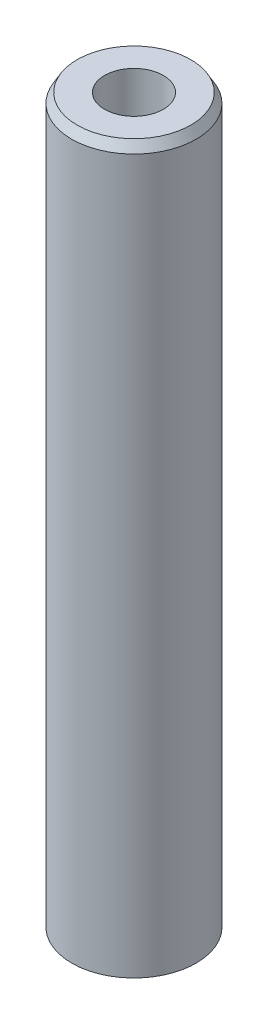
ISO-10303-21;
HEADER;
FILE_DESCRIPTION(('STEP AP214'),'2;1');
FILE_NAME('part.step','',(''),(''),'','','');
FILE_SCHEMA(('AUTOMOTIVE_DESIGN { 1 0 10303 214 1 1 1 1 }'));
ENDSEC;
DATA;
#1=APPLICATION_CONTEXT('core data for automotive mechanical design processes');
#2=APPLICATION_PROTOCOL_DEFINITION('international standard','automotive_design',2000,#1);
#3=PRODUCT_CONTEXT('',#1,'mechanical');
#4=PRODUCT('Part','Part','',(#3));
#5=PRODUCT_RELATED_PRODUCT_CATEGORY('part','',(#4));
#6=PRODUCT_DEFINITION_FORMATION('','',#4);
#7=PRODUCT_DEFINITION_CONTEXT('part definition',#1,'design');
#8=PRODUCT_DEFINITION('design','',#6,#7);
#9=PRODUCT_DEFINITION_SHAPE('','',#8);
#10=(LENGTH_UNIT() NAMED_UNIT(*) SI_UNIT(.MILLI.,.METRE.));
#11=(NAMED_UNIT(*) PLANE_ANGLE_UNIT() SI_UNIT($,.RADIAN.));
#12=(NAMED_UNIT(*) SI_UNIT($,.STERADIAN.) SOLID_ANGLE_UNIT());
#13=UNCERTAINTY_MEASURE_WITH_UNIT(LENGTH_MEASURE(1.E-05),#10,'distance_accuracy_value','');
#14=(GEOMETRIC_REPRESENTATION_CONTEXT(3) GLOBAL_UNCERTAINTY_ASSIGNED_CONTEXT((#13)) GLOBAL_UNIT_ASSIGNED_CONTEXT((#10,
#11,#12)) REPRESENTATION_CONTEXT('',''));
#15=CARTESIAN_POINT('',(0.,0.,0.));
#16=DIRECTION('',(0.,0.,1.));
#17=DIRECTION('',(1.,0.,0.));
#18=AXIS2_PLACEMENT_3D('',#15,#16,#17);
#19=CARTESIAN_POINT('',(0.,292.559721245238,0.));
#20=DIRECTION('',(0.,-1.,0.));
#21=DIRECTION('',(0.,0.,-1.));
#22=AXIS2_PLACEMENT_3D('',#19,#20,#21);
#23=CYLINDRICAL_SURFACE('',#22,25.);
#24=CARTESIAN_POINT('',(0.,288.758786102164,0.));
#25=DIRECTION('',(0.,1.,0.));
#26=DIRECTION('',(0.,0.,1.));
#27=AXIS2_PLACEMENT_3D('',#24,#25,#26);
#28=CIRCLE('',#27,25.);
#29=CARTESIAN_POINT('',(0.,288.758786102164,25.));
#30=VERTEX_POINT('',#29);
#31=EDGE_CURVE('E50',#30,#30,#28,.F.);
#32=ORIENTED_EDGE('',*,*,#31,.T.);
#33=EDGE_LOOP('',(#32));
#34=FACE_BOUND('',#33,.T.);
#35=CARTESIAN_POINT('',(0.,2.19447092802638,0.));
#36=DIRECTION('',(0.,1.,0.));
#37=DIRECTION('',(0.,0.,1.));
#38=AXIS2_PLACEMENT_3D('',#35,#36,#37);
#39=CIRCLE('',#38,25.);
#40=CARTESIAN_POINT('',(0.,2.19447092802638,25.));
#41=VERTEX_POINT('',#40);
#42=EDGE_CURVE('E51',#41,#41,#39,.T.);
#43=ORIENTED_EDGE('',*,*,#42,.T.);
#44=EDGE_LOOP('',(#43));
#45=FACE_BOUND('',#44,.T.);
#46=ADVANCED_FACE('F39',(#34,#45),#23,.T.);
#47=CARTESIAN_POINT('',(0.,292.559721245238,0.));
#48=DIRECTION('',(0.,1.,0.));
#49=DIRECTION('',(0.,0.,1.));
#50=AXIS2_PLACEMENT_3D('',#47,#48,#49);
#51=PLANE('',#50);
#52=CARTESIAN_POINT('',(0.,292.559721245238,0.));
#53=DIRECTION('',(0.,1.,0.));
#54=DIRECTION('',(0.,0.,1.));
#55=AXIS2_PLACEMENT_3D('',#52,#53,#54);
#56=CIRCLE('',#55,22.8055290719736);
#57=CARTESIAN_POINT('',(0.,292.559721245238,22.8055290719736));
#58=VERTEX_POINT('',#57);
#59=EDGE_CURVE('E54',#58,#58,#56,.T.);
#60=ORIENTED_EDGE('',*,*,#59,.T.);
#61=EDGE_LOOP('',(#60));
#62=FACE_BOUND('',#61,.T.);
#63=CARTESIAN_POINT('',(0.,292.559721245238,0.));
#64=DIRECTION('',(0.,1.,0.));
#65=DIRECTION('',(0.,0.,1.));
#66=AXIS2_PLACEMENT_3D('',#63,#64,#65);
#67=CIRCLE('',#66,11.8043987662337);
#68=CARTESIAN_POINT('',(0.,292.559721245238,11.8043987662337));
#69=VERTEX_POINT('',#68);
#70=EDGE_CURVE('E58',#69,#69,#67,.T.);
#71=ORIENTED_EDGE('',*,*,#70,.F.);
#72=EDGE_LOOP('',(#71));
#73=FACE_BOUND('',#72,.T.);
#74=ADVANCED_FACE('F69',(#62,#73),#51,.T.);
#75=CARTESIAN_POINT('',(0.,0.,0.));
#76=DIRECTION('',(0.,1.,0.));
#77=DIRECTION('',(0.,0.,1.));
#78=AXIS2_PLACEMENT_3D('',#75,#76,#77);
#79=PLANE('',#78);
#80=CARTESIAN_POINT('',(0.,0.,0.));
#81=DIRECTION('',(0.,1.,0.));
#82=DIRECTION('',(0.,0.,1.));
#83=AXIS2_PLACEMENT_3D('',#80,#81,#82);
#84=CIRCLE('',#83,21.1990648569255);
#85=CARTESIAN_POINT('',(0.,0.,21.1990648569255));
#86=VERTEX_POINT('',#85);
#87=EDGE_CURVE('E10',#86,#86,#84,.F.);
#88=ORIENTED_EDGE('',*,*,#87,.T.);
#89=EDGE_LOOP('',(#88));
#90=FACE_BOUND('',#89,.T.);
#91=CARTESIAN_POINT('',(0.,0.,0.));
#92=DIRECTION('',(0.,1.,0.));
#93=DIRECTION('',(0.,0.,1.));
#94=AXIS2_PLACEMENT_3D('',#91,#92,#93);
#95=CIRCLE('',#94,11.8043987662337);
#96=CARTESIAN_POINT('',(0.,0.,11.8043987662337));
#97=VERTEX_POINT('',#96);
#98=EDGE_CURVE('E63',#97,#97,#95,.T.);
#99=ORIENTED_EDGE('',*,*,#98,.T.);
#100=EDGE_LOOP('',(#99));
#101=FACE_BOUND('',#100,.T.);
#102=ADVANCED_FACE('F75',(#90,#101),#79,.F.);
#103=CARTESIAN_POINT('',(0.,292.559721245238,0.));
#104=DIRECTION('',(0.,-1.,0.));
#105=DIRECTION('',(0.,0.,-1.));
#106=AXIS2_PLACEMENT_3D('',#103,#104,#105);
#107=CYLINDRICAL_SURFACE('',#106,11.8043987662337);
#108=ORIENTED_EDGE('',*,*,#70,.T.);
#109=EDGE_LOOP('',(#108));
#110=FACE_BOUND('',#109,.T.);
#111=ORIENTED_EDGE('',*,*,#98,.F.);
#112=EDGE_LOOP('',(#111));
#113=FACE_BOUND('',#112,.T.);
#114=ADVANCED_FACE('F70',(#110,#113),#107,.F.);
#115=CARTESIAN_POINT('',(0.,292.559721245238,0.));
#116=DIRECTION('',(0.,-1.,0.));
#117=DIRECTION('',(0.,0.,-1.));
#118=AXIS2_PLACEMENT_3D('',#115,#116,#117);
#119=CONICAL_SURFACE('',#118,22.8055290719736,0.523598775598295);
#120=ORIENTED_EDGE('',*,*,#31,.F.);
#121=EDGE_LOOP('',(#120));
#122=FACE_BOUND('',#121,.T.);
#123=ORIENTED_EDGE('',*,*,#59,.F.);
#124=EDGE_LOOP('',(#123));
#125=FACE_BOUND('',#124,.T.);
#126=ADVANCED_FACE('F81',(#122,#125),#119,.T.);
#127=CARTESIAN_POINT('',(0.,2.19447092802638,0.));
#128=DIRECTION('',(0.,1.,0.));
#129=DIRECTION('',(0.,0.,1.));
#130=AXIS2_PLACEMENT_3D('',#127,#128,#129);
#131=CONICAL_SURFACE('',#130,25.,1.0471975511966);
#132=ORIENTED_EDGE('',*,*,#87,.F.);
#133=EDGE_LOOP('',(#132));
#134=FACE_BOUND('',#133,.T.);
#135=ORIENTED_EDGE('',*,*,#42,.F.);
#136=EDGE_LOOP('',(#135));
#137=FACE_BOUND('',#136,.T.);
#138=ADVANCED_FACE('F45',(#134,#137),#131,.T.);
#139=CLOSED_SHELL('',(#46,#74,#102,#114,#126,#138));
#140=MANIFOLD_SOLID_BREP('B2',#139);
#141=ADVANCED_BREP_SHAPE_REPRESENTATION('',(#18,#140),#14);
#142=SHAPE_DEFINITION_REPRESENTATION(#9,#141);
ENDSEC;
END-ISO-10303-21;
